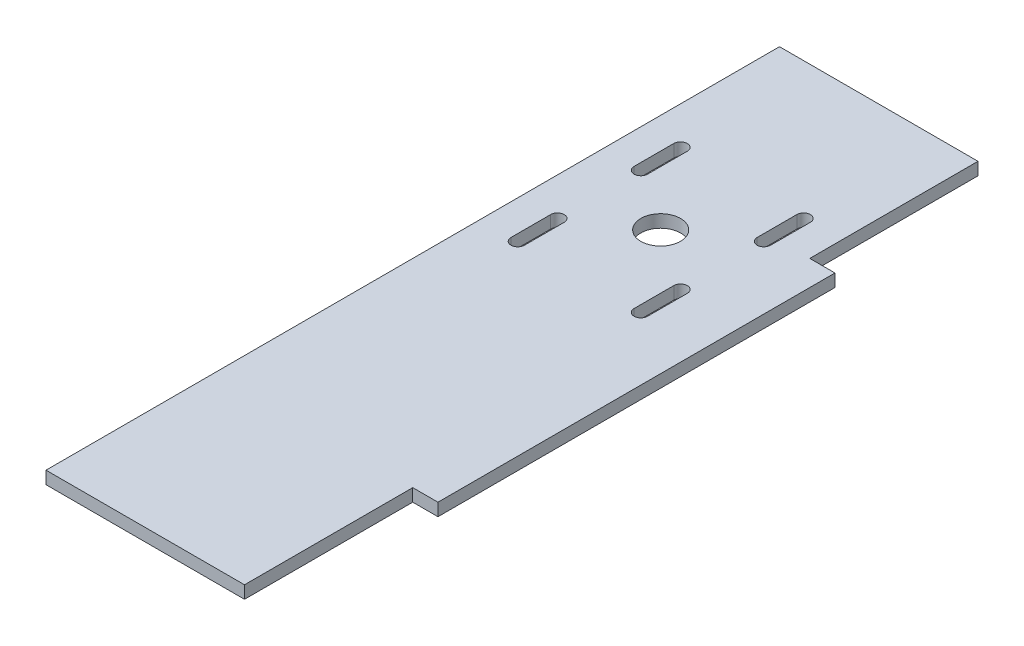
ISO-10303-21;
HEADER;
FILE_DESCRIPTION(('STEP AP214'),'2;1');
FILE_NAME('part.step','',(''),(''),'','','');
FILE_SCHEMA(('AUTOMOTIVE_DESIGN { 1 0 10303 214 1 1 1 1 }'));
ENDSEC;
DATA;
#1=APPLICATION_CONTEXT('core data for automotive mechanical design processes');
#2=APPLICATION_PROTOCOL_DEFINITION('international standard','automotive_design',2000,#1);
#3=PRODUCT_CONTEXT('',#1,'mechanical');
#4=PRODUCT('Part','Part','',(#3));
#5=PRODUCT_RELATED_PRODUCT_CATEGORY('part','',(#4));
#6=PRODUCT_DEFINITION_FORMATION('','',#4);
#7=PRODUCT_DEFINITION_CONTEXT('part definition',#1,'design');
#8=PRODUCT_DEFINITION('design','',#6,#7);
#9=PRODUCT_DEFINITION_SHAPE('','',#8);
#10=(LENGTH_UNIT() NAMED_UNIT(*) SI_UNIT(.MILLI.,.METRE.));
#11=(NAMED_UNIT(*) PLANE_ANGLE_UNIT() SI_UNIT($,.RADIAN.));
#12=(NAMED_UNIT(*) SI_UNIT($,.STERADIAN.) SOLID_ANGLE_UNIT());
#13=UNCERTAINTY_MEASURE_WITH_UNIT(LENGTH_MEASURE(1.E-05),#10,'distance_accuracy_value','');
#14=(GEOMETRIC_REPRESENTATION_CONTEXT(3) GLOBAL_UNCERTAINTY_ASSIGNED_CONTEXT((#13)) GLOBAL_UNIT_ASSIGNED_CONTEXT((#10,
#11,#12)) REPRESENTATION_CONTEXT('',''));
#15=CARTESIAN_POINT('',(0.,0.,0.));
#16=DIRECTION('',(0.,0.,1.));
#17=DIRECTION('',(1.,0.,0.));
#18=AXIS2_PLACEMENT_3D('',#15,#16,#17);
#19=CARTESIAN_POINT('',(-25.,3.175,0.));
#20=DIRECTION('',(-1.,0.,0.));
#21=DIRECTION('',(0.,0.,1.));
#22=AXIS2_PLACEMENT_3D('',#19,#20,#21);
#23=PLANE('',#22);
#24=DIRECTION('',(0.,0.,-1.));
#25=VECTOR('',#24,1.);
#26=CARTESIAN_POINT('',(-25.,0.,0.));
#27=LINE('',#26,#25);
#28=CARTESIAN_POINT('',(-25.,0.,142.375));
#29=VERTEX_POINT('',#28);
#30=CARTESIAN_POINT('',(-25.,0.,-42.375));
#31=VERTEX_POINT('',#30);
#32=EDGE_CURVE('E338',#29,#31,#27,.T.);
#33=ORIENTED_EDGE('',*,*,#32,.F.);
#34=DIRECTION('',(0.,-1.,0.));
#35=VECTOR('',#34,1.);
#36=CARTESIAN_POINT('',(-25.,3.175,142.375));
#37=LINE('',#36,#35);
#38=CARTESIAN_POINT('',(-25.,3.175,142.375));
#39=VERTEX_POINT('',#38);
#40=EDGE_CURVE('E11',#39,#29,#37,.T.);
#41=ORIENTED_EDGE('',*,*,#40,.F.);
#42=DIRECTION('',(0.,0.,-1.));
#43=VECTOR('',#42,1.);
#44=CARTESIAN_POINT('',(-25.,3.175,0.));
#45=LINE('',#44,#43);
#46=CARTESIAN_POINT('',(-25.,3.175,-42.375));
#47=VERTEX_POINT('',#46);
#48=EDGE_CURVE('E341',#39,#47,#45,.T.);
#49=ORIENTED_EDGE('',*,*,#48,.T.);
#50=DIRECTION('',(0.,-1.,0.));
#51=VECTOR('',#50,1.);
#52=CARTESIAN_POINT('',(-25.,3.175,-42.375));
#53=LINE('',#52,#51);
#54=EDGE_CURVE('E366',#47,#31,#53,.T.);
#55=ORIENTED_EDGE('',*,*,#54,.T.);
#56=EDGE_LOOP('',(#33,#41,#49,#55));
#57=FACE_BOUND('',#56,.T.);
#58=ADVANCED_FACE('F36',(#57),#23,.T.);
#59=CARTESIAN_POINT('',(0.,3.175,142.375));
#60=DIRECTION('',(0.,0.,1.));
#61=DIRECTION('',(1.,0.,0.));
#62=AXIS2_PLACEMENT_3D('',#59,#60,#61);
#63=PLANE('',#62);
#64=DIRECTION('',(-1.,0.,0.));
#65=VECTOR('',#64,1.);
#66=CARTESIAN_POINT('',(0.,0.,142.375));
#67=LINE('',#66,#65);
#68=CARTESIAN_POINT('',(25.,0.,142.375));
#69=VERTEX_POINT('',#68);
#70=EDGE_CURVE('E369',#69,#29,#67,.T.);
#71=ORIENTED_EDGE('',*,*,#70,.F.);
#72=DIRECTION('',(0.,-1.,0.));
#73=VECTOR('',#72,1.);
#74=CARTESIAN_POINT('',(25.,3.175,142.375));
#75=LINE('',#74,#73);
#76=CARTESIAN_POINT('',(25.,3.175,142.375));
#77=VERTEX_POINT('',#76);
#78=EDGE_CURVE('E43',#77,#69,#75,.T.);
#79=ORIENTED_EDGE('',*,*,#78,.F.);
#80=DIRECTION('',(-1.,0.,0.));
#81=VECTOR('',#80,1.);
#82=CARTESIAN_POINT('',(0.,3.175,142.375));
#83=LINE('',#82,#81);
#84=EDGE_CURVE('E344',#77,#39,#83,.T.);
#85=ORIENTED_EDGE('',*,*,#84,.T.);
#86=ORIENTED_EDGE('',*,*,#40,.T.);
#87=EDGE_LOOP('',(#71,#79,#85,#86));
#88=FACE_BOUND('',#87,.T.);
#89=ADVANCED_FACE('F406',(#88),#63,.T.);
#90=CARTESIAN_POINT('',(25.,3.175,0.));
#91=DIRECTION('',(1.,0.,0.));
#92=DIRECTION('',(0.,0.,-1.));
#93=AXIS2_PLACEMENT_3D('',#90,#91,#92);
#94=PLANE('',#93);
#95=DIRECTION('',(0.,0.,1.));
#96=VECTOR('',#95,1.);
#97=CARTESIAN_POINT('',(25.,0.,0.));
#98=LINE('',#97,#96);
#99=CARTESIAN_POINT('',(25.,0.,100.));
#100=VERTEX_POINT('',#99);
#101=EDGE_CURVE('E372',#100,#69,#98,.T.);
#102=ORIENTED_EDGE('',*,*,#101,.F.);
#103=DIRECTION('',(0.,-1.,0.));
#104=VECTOR('',#103,1.);
#105=CARTESIAN_POINT('',(25.,3.175,100.));
#106=LINE('',#105,#104);
#107=CARTESIAN_POINT('',(25.,3.175,100.));
#108=VERTEX_POINT('',#107);
#109=EDGE_CURVE('E398',#108,#100,#106,.T.);
#110=ORIENTED_EDGE('',*,*,#109,.F.);
#111=DIRECTION('',(0.,0.,1.));
#112=VECTOR('',#111,1.);
#113=CARTESIAN_POINT('',(25.,3.175,0.));
#114=LINE('',#113,#112);
#115=EDGE_CURVE('E348',#108,#77,#114,.T.);
#116=ORIENTED_EDGE('',*,*,#115,.T.);
#117=ORIENTED_EDGE('',*,*,#78,.T.);
#118=EDGE_LOOP('',(#102,#110,#116,#117));
#119=FACE_BOUND('',#118,.T.);
#120=ADVANCED_FACE('F402',(#119),#94,.T.);
#121=CARTESIAN_POINT('',(0.,3.175,100.));
#122=DIRECTION('',(0.,0.,1.));
#123=DIRECTION('',(1.,0.,0.));
#124=AXIS2_PLACEMENT_3D('',#121,#122,#123);
#125=PLANE('',#124);
#126=DIRECTION('',(-1.,0.,0.));
#127=VECTOR('',#126,1.);
#128=CARTESIAN_POINT('',(0.,0.,100.));
#129=LINE('',#128,#127);
#130=CARTESIAN_POINT('',(31.35,0.,100.));
#131=VERTEX_POINT('',#130);
#132=EDGE_CURVE('E375',#131,#100,#129,.T.);
#133=ORIENTED_EDGE('',*,*,#132,.F.);
#134=DIRECTION('',(0.,-1.,0.));
#135=VECTOR('',#134,1.);
#136=CARTESIAN_POINT('',(31.35,3.175,100.));
#137=LINE('',#136,#135);
#138=CARTESIAN_POINT('',(31.35,3.175,100.));
#139=VERTEX_POINT('',#138);
#140=EDGE_CURVE('E396',#139,#131,#137,.T.);
#141=ORIENTED_EDGE('',*,*,#140,.F.);
#142=DIRECTION('',(-1.,0.,0.));
#143=VECTOR('',#142,1.);
#144=CARTESIAN_POINT('',(0.,3.175,100.));
#145=LINE('',#144,#143);
#146=EDGE_CURVE('E351',#139,#108,#145,.T.);
#147=ORIENTED_EDGE('',*,*,#146,.T.);
#148=ORIENTED_EDGE('',*,*,#109,.T.);
#149=EDGE_LOOP('',(#133,#141,#147,#148));
#150=FACE_BOUND('',#149,.T.);
#151=ADVANCED_FACE('F412',(#150),#125,.T.);
#152=CARTESIAN_POINT('',(31.35,3.175,0.));
#153=DIRECTION('',(1.,0.,0.));
#154=DIRECTION('',(0.,0.,-1.));
#155=AXIS2_PLACEMENT_3D('',#152,#153,#154);
#156=PLANE('',#155);
#157=DIRECTION('',(0.,0.,1.));
#158=VECTOR('',#157,1.);
#159=CARTESIAN_POINT('',(31.35,0.,0.));
#160=LINE('',#159,#158);
#161=CARTESIAN_POINT('',(31.35,0.,0.));
#162=VERTEX_POINT('',#161);
#163=EDGE_CURVE('E378',#162,#131,#160,.T.);
#164=ORIENTED_EDGE('',*,*,#163,.F.);
#165=DIRECTION('',(0.,-1.,0.));
#166=VECTOR('',#165,1.);
#167=CARTESIAN_POINT('',(31.35,3.175,0.));
#168=LINE('',#167,#166);
#169=CARTESIAN_POINT('',(31.35,3.175,0.));
#170=VERTEX_POINT('',#169);
#171=EDGE_CURVE('E394',#170,#162,#168,.T.);
#172=ORIENTED_EDGE('',*,*,#171,.F.);
#173=DIRECTION('',(0.,0.,1.));
#174=VECTOR('',#173,1.);
#175=CARTESIAN_POINT('',(31.35,3.175,0.));
#176=LINE('',#175,#174);
#177=EDGE_CURVE('E354',#170,#139,#176,.T.);
#178=ORIENTED_EDGE('',*,*,#177,.T.);
#179=ORIENTED_EDGE('',*,*,#140,.T.);
#180=EDGE_LOOP('',(#164,#172,#178,#179));
#181=FACE_BOUND('',#180,.T.);
#182=ADVANCED_FACE('F432',(#181),#156,.T.);
#183=CARTESIAN_POINT('',(0.,3.175,0.));
#184=DIRECTION('',(0.,0.,-1.));
#185=DIRECTION('',(-1.,0.,0.));
#186=AXIS2_PLACEMENT_3D('',#183,#184,#185);
#187=PLANE('',#186);
#188=DIRECTION('',(1.,0.,0.));
#189=VECTOR('',#188,1.);
#190=CARTESIAN_POINT('',(0.,0.,0.));
#191=LINE('',#190,#189);
#192=CARTESIAN_POINT('',(25.,0.,0.));
#193=VERTEX_POINT('',#192);
#194=EDGE_CURVE('E381',#193,#162,#191,.T.);
#195=ORIENTED_EDGE('',*,*,#194,.F.);
#196=DIRECTION('',(0.,-1.,0.));
#197=VECTOR('',#196,1.);
#198=CARTESIAN_POINT('',(25.,3.175,0.));
#199=LINE('',#198,#197);
#200=CARTESIAN_POINT('',(25.,3.175,0.));
#201=VERTEX_POINT('',#200);
#202=EDGE_CURVE('E392',#201,#193,#199,.T.);
#203=ORIENTED_EDGE('',*,*,#202,.F.);
#204=DIRECTION('',(1.,0.,0.));
#205=VECTOR('',#204,1.);
#206=CARTESIAN_POINT('',(0.,3.175,0.));
#207=LINE('',#206,#205);
#208=EDGE_CURVE('E357',#201,#170,#207,.T.);
#209=ORIENTED_EDGE('',*,*,#208,.T.);
#210=ORIENTED_EDGE('',*,*,#171,.T.);
#211=EDGE_LOOP('',(#195,#203,#209,#210));
#212=FACE_BOUND('',#211,.T.);
#213=ADVANCED_FACE('F429',(#212),#187,.T.);
#214=CARTESIAN_POINT('',(25.,3.175,0.));
#215=DIRECTION('',(1.,0.,0.));
#216=DIRECTION('',(0.,0.,-1.));
#217=AXIS2_PLACEMENT_3D('',#214,#215,#216);
#218=PLANE('',#217);
#219=DIRECTION('',(0.,0.,1.));
#220=VECTOR('',#219,1.);
#221=CARTESIAN_POINT('',(25.,0.,0.));
#222=LINE('',#221,#220);
#223=CARTESIAN_POINT('',(25.,0.,-42.375));
#224=VERTEX_POINT('',#223);
#225=EDGE_CURVE('E384',#224,#193,#222,.T.);
#226=ORIENTED_EDGE('',*,*,#225,.F.);
#227=DIRECTION('',(0.,-1.,0.));
#228=VECTOR('',#227,1.);
#229=CARTESIAN_POINT('',(25.,3.175,-42.375));
#230=LINE('',#229,#228);
#231=CARTESIAN_POINT('',(25.,3.175,-42.375));
#232=VERTEX_POINT('',#231);
#233=EDGE_CURVE('E390',#232,#224,#230,.T.);
#234=ORIENTED_EDGE('',*,*,#233,.F.);
#235=DIRECTION('',(0.,0.,1.));
#236=VECTOR('',#235,1.);
#237=CARTESIAN_POINT('',(25.,3.175,0.));
#238=LINE('',#237,#236);
#239=EDGE_CURVE('E360',#232,#201,#238,.T.);
#240=ORIENTED_EDGE('',*,*,#239,.T.);
#241=ORIENTED_EDGE('',*,*,#202,.T.);
#242=EDGE_LOOP('',(#226,#234,#240,#241));
#243=FACE_BOUND('',#242,.T.);
#244=ADVANCED_FACE('F426',(#243),#218,.T.);
#245=CARTESIAN_POINT('',(0.,3.175,-42.375));
#246=DIRECTION('',(0.,0.,-1.));
#247=DIRECTION('',(-1.,0.,0.));
#248=AXIS2_PLACEMENT_3D('',#245,#246,#247);
#249=PLANE('',#248);
#250=DIRECTION('',(1.,0.,0.));
#251=VECTOR('',#250,1.);
#252=CARTESIAN_POINT('',(0.,0.,-42.375));
#253=LINE('',#252,#251);
#254=EDGE_CURVE('E345',#31,#224,#253,.T.);
#255=ORIENTED_EDGE('',*,*,#254,.F.);
#256=ORIENTED_EDGE('',*,*,#54,.F.);
#257=DIRECTION('',(1.,0.,0.));
#258=VECTOR('',#257,1.);
#259=CARTESIAN_POINT('',(0.,3.175,-42.375));
#260=LINE('',#259,#258);
#261=EDGE_CURVE('E363',#47,#232,#260,.T.);
#262=ORIENTED_EDGE('',*,*,#261,.T.);
#263=ORIENTED_EDGE('',*,*,#233,.T.);
#264=EDGE_LOOP('',(#255,#256,#262,#263));
#265=FACE_BOUND('',#264,.T.);
#266=ADVANCED_FACE('F423',(#265),#249,.T.);
#267=CARTESIAN_POINT('',(0.,3.175,0.));
#268=DIRECTION('',(0.,1.,0.));
#269=DIRECTION('',(0.,0.,1.));
#270=AXIS2_PLACEMENT_3D('',#267,#268,#269);
#271=PLANE('',#270);
#272=DIRECTION('',(0.,0.,1.));
#273=VECTOR('',#272,1.);
#274=CARTESIAN_POINT('',(-17.2,3.175,33.05));
#275=LINE('',#274,#273);
#276=CARTESIAN_POINT('',(-17.2,3.175,23.05));
#277=VERTEX_POINT('',#276);
#278=CARTESIAN_POINT('',(-17.2,3.175,33.05));
#279=VERTEX_POINT('',#278);
#280=EDGE_CURVE('E220',#277,#279,#275,.T.);
#281=ORIENTED_EDGE('',*,*,#280,.F.);
#282=CARTESIAN_POINT('',(-15.5,3.175,23.05));
#283=DIRECTION('',(0.,1.,0.));
#284=DIRECTION('',(0.,0.,-1.));
#285=AXIS2_PLACEMENT_3D('',#282,#283,#284);
#286=CIRCLE('',#285,1.7);
#287=CARTESIAN_POINT('',(-13.8,3.175,23.05));
#288=VERTEX_POINT('',#287);
#289=EDGE_CURVE('E222',#288,#277,#286,.T.);
#290=ORIENTED_EDGE('',*,*,#289,.F.);
#291=DIRECTION('',(0.,0.,-1.));
#292=VECTOR('',#291,1.);
#293=CARTESIAN_POINT('',(-13.8,3.175,33.05));
#294=LINE('',#293,#292);
#295=CARTESIAN_POINT('',(-13.8,3.175,33.05));
#296=VERTEX_POINT('',#295);
#297=EDGE_CURVE('E228',#296,#288,#294,.T.);
#298=ORIENTED_EDGE('',*,*,#297,.F.);
#299=CARTESIAN_POINT('',(-15.5,3.175,33.05));
#300=DIRECTION('',(0.,1.,0.));
#301=DIRECTION('',(0.,0.,-1.));
#302=AXIS2_PLACEMENT_3D('',#299,#300,#301);
#303=CIRCLE('',#302,1.7);
#304=EDGE_CURVE('E214',#279,#296,#303,.T.);
#305=ORIENTED_EDGE('',*,*,#304,.F.);
#306=EDGE_LOOP('',(#281,#290,#298,#305));
#307=FACE_BOUND('',#306,.T.);
#308=DIRECTION('',(0.,0.,1.));
#309=VECTOR('',#308,1.);
#310=CARTESIAN_POINT('',(13.8,3.175,33.05));
#311=LINE('',#310,#309);
#312=CARTESIAN_POINT('',(13.8,3.175,23.05));
#313=VERTEX_POINT('',#312);
#314=CARTESIAN_POINT('',(13.8,3.175,33.05));
#315=VERTEX_POINT('',#314);
#316=EDGE_CURVE('E243',#313,#315,#311,.T.);
#317=ORIENTED_EDGE('',*,*,#316,.F.);
#318=CARTESIAN_POINT('',(15.5,3.175,23.05));
#319=DIRECTION('',(0.,1.,0.));
#320=DIRECTION('',(0.,0.,-1.));
#321=AXIS2_PLACEMENT_3D('',#318,#319,#320);
#322=CIRCLE('',#321,1.69999999999999);
#323=CARTESIAN_POINT('',(17.2,3.175,23.05));
#324=VERTEX_POINT('',#323);
#325=EDGE_CURVE('E255',#324,#313,#322,.T.);
#326=ORIENTED_EDGE('',*,*,#325,.F.);
#327=DIRECTION('',(0.,0.,-1.));
#328=VECTOR('',#327,1.);
#329=CARTESIAN_POINT('',(17.2,3.175,33.05));
#330=LINE('',#329,#328);
#331=CARTESIAN_POINT('',(17.2,3.175,33.05));
#332=VERTEX_POINT('',#331);
#333=EDGE_CURVE('E253',#332,#324,#330,.T.);
#334=ORIENTED_EDGE('',*,*,#333,.F.);
#335=CARTESIAN_POINT('',(15.5,3.175,33.05));
#336=DIRECTION('',(0.,1.,0.));
#337=DIRECTION('',(0.,0.,-1.));
#338=AXIS2_PLACEMENT_3D('',#335,#336,#337);
#339=CIRCLE('',#338,1.69999999999999);
#340=EDGE_CURVE('E234',#315,#332,#339,.T.);
#341=ORIENTED_EDGE('',*,*,#340,.F.);
#342=EDGE_LOOP('',(#317,#326,#334,#341));
#343=FACE_BOUND('',#342,.T.);
#344=DIRECTION('',(0.,0.,-1.));
#345=VECTOR('',#344,1.);
#346=CARTESIAN_POINT('',(-13.8,3.175,-7.95000000000001));
#347=LINE('',#346,#345);
#348=CARTESIAN_POINT('',(-13.8,3.175,2.04999999999999));
#349=VERTEX_POINT('',#348);
#350=CARTESIAN_POINT('',(-13.8,3.175,-7.95000000000001));
#351=VERTEX_POINT('',#350);
#352=EDGE_CURVE('E273',#349,#351,#347,.T.);
#353=ORIENTED_EDGE('',*,*,#352,.F.);
#354=CARTESIAN_POINT('',(-15.5,3.175,2.04999999999999));
#355=DIRECTION('',(0.,1.,0.));
#356=DIRECTION('',(0.,0.,1.));
#357=AXIS2_PLACEMENT_3D('',#354,#355,#356);
#358=CIRCLE('',#357,1.7);
#359=CARTESIAN_POINT('',(-17.2,3.175,2.05));
#360=VERTEX_POINT('',#359);
#361=EDGE_CURVE('E287',#360,#349,#358,.T.);
#362=ORIENTED_EDGE('',*,*,#361,.F.);
#363=DIRECTION('',(0.,0.,1.));
#364=VECTOR('',#363,1.);
#365=CARTESIAN_POINT('',(-17.2,3.175,-7.95000000000001));
#366=LINE('',#365,#364);
#367=CARTESIAN_POINT('',(-17.2,3.175,-7.95000000000001));
#368=VERTEX_POINT('',#367);
#369=EDGE_CURVE('E285',#368,#360,#366,.T.);
#370=ORIENTED_EDGE('',*,*,#369,.F.);
#371=CARTESIAN_POINT('',(-15.5,3.175,-7.95000000000001));
#372=DIRECTION('',(0.,1.,0.));
#373=DIRECTION('',(0.,0.,1.));
#374=AXIS2_PLACEMENT_3D('',#371,#372,#373);
#375=CIRCLE('',#374,1.7);
#376=EDGE_CURVE('E262',#351,#368,#375,.T.);
#377=ORIENTED_EDGE('',*,*,#376,.F.);
#378=EDGE_LOOP('',(#353,#362,#370,#377));
#379=FACE_BOUND('',#378,.T.);
#380=DIRECTION('',(0.,0.,-1.));
#381=VECTOR('',#380,1.);
#382=CARTESIAN_POINT('',(17.2,3.175,-7.95000000000002));
#383=LINE('',#382,#381);
#384=CARTESIAN_POINT('',(17.2,3.175,2.04999999999998));
#385=VERTEX_POINT('',#384);
#386=CARTESIAN_POINT('',(17.2,3.175,-7.95000000000002));
#387=VERTEX_POINT('',#386);
#388=EDGE_CURVE('E306',#385,#387,#383,.T.);
#389=ORIENTED_EDGE('',*,*,#388,.F.);
#390=CARTESIAN_POINT('',(15.5,3.175,2.04999999999998));
#391=DIRECTION('',(0.,1.,0.));
#392=DIRECTION('',(0.,0.,1.));
#393=AXIS2_PLACEMENT_3D('',#390,#391,#392);
#394=CIRCLE('',#393,1.69999999999999);
#395=CARTESIAN_POINT('',(13.8,3.175,2.04999999999999));
#396=VERTEX_POINT('',#395);
#397=EDGE_CURVE('E320',#396,#385,#394,.T.);
#398=ORIENTED_EDGE('',*,*,#397,.F.);
#399=DIRECTION('',(0.,0.,1.));
#400=VECTOR('',#399,1.);
#401=CARTESIAN_POINT('',(13.8,3.175,-7.95000000000003));
#402=LINE('',#401,#400);
#403=CARTESIAN_POINT('',(13.8,3.175,-7.95000000000003));
#404=VERTEX_POINT('',#403);
#405=EDGE_CURVE('E318',#404,#396,#402,.T.);
#406=ORIENTED_EDGE('',*,*,#405,.F.);
#407=CARTESIAN_POINT('',(15.5,3.175,-7.95000000000002));
#408=DIRECTION('',(0.,1.,0.));
#409=DIRECTION('',(0.,0.,1.));
#410=AXIS2_PLACEMENT_3D('',#407,#408,#409);
#411=CIRCLE('',#410,1.69999999999999);
#412=EDGE_CURVE('E294',#387,#404,#411,.T.);
#413=ORIENTED_EDGE('',*,*,#412,.F.);
#414=EDGE_LOOP('',(#389,#398,#406,#413));
#415=FACE_BOUND('',#414,.T.);
#416=CARTESIAN_POINT('',(0.,3.175,12.55));
#417=DIRECTION('',(0.,1.,0.));
#418=DIRECTION('',(0.,0.,1.));
#419=AXIS2_PLACEMENT_3D('',#416,#417,#418);
#420=CIRCLE('',#419,5.);
#421=CARTESIAN_POINT('',(0.,3.175,17.55));
#422=VERTEX_POINT('',#421);
#423=EDGE_CURVE('E327',#422,#422,#420,.T.);
#424=ORIENTED_EDGE('',*,*,#423,.F.);
#425=EDGE_LOOP('',(#424));
#426=FACE_BOUND('',#425,.T.);
#427=ORIENTED_EDGE('',*,*,#48,.F.);
#428=ORIENTED_EDGE('',*,*,#84,.F.);
#429=ORIENTED_EDGE('',*,*,#115,.F.);
#430=ORIENTED_EDGE('',*,*,#146,.F.);
#431=ORIENTED_EDGE('',*,*,#177,.F.);
#432=ORIENTED_EDGE('',*,*,#208,.F.);
#433=ORIENTED_EDGE('',*,*,#239,.F.);
#434=ORIENTED_EDGE('',*,*,#261,.F.);
#435=EDGE_LOOP('',(#427,#428,#429,#430,#431,#432,#433,#434));
#436=FACE_BOUND('',#435,.T.);
#437=ADVANCED_FACE('F416',(#307,#343,#379,#415,#426,#436),#271,.T.);
#438=CARTESIAN_POINT('',(0.,0.,0.));
#439=DIRECTION('',(0.,1.,0.));
#440=DIRECTION('',(0.,0.,1.));
#441=AXIS2_PLACEMENT_3D('',#438,#439,#440);
#442=PLANE('',#441);
#443=CARTESIAN_POINT('',(-15.5,0.,2.04999999999999));
#444=DIRECTION('',(0.,1.,0.));
#445=DIRECTION('',(0.,0.,1.));
#446=AXIS2_PLACEMENT_3D('',#443,#444,#445);
#447=CIRCLE('',#446,1.7);
#448=CARTESIAN_POINT('',(-17.2,0.,2.05));
#449=VERTEX_POINT('',#448);
#450=CARTESIAN_POINT('',(-13.8,0.,2.04999999999999));
#451=VERTEX_POINT('',#450);
#452=EDGE_CURVE('E276',#449,#451,#447,.T.);
#453=ORIENTED_EDGE('',*,*,#452,.T.);
#454=DIRECTION('',(0.,0.,-1.));
#455=VECTOR('',#454,1.);
#456=CARTESIAN_POINT('',(-13.8,0.,-7.95000000000001));
#457=LINE('',#456,#455);
#458=CARTESIAN_POINT('',(-13.8,0.,-7.95000000000001));
#459=VERTEX_POINT('',#458);
#460=EDGE_CURVE('E279',#451,#459,#457,.T.);
#461=ORIENTED_EDGE('',*,*,#460,.T.);
#462=CARTESIAN_POINT('',(-15.5,0.,-7.95000000000001));
#463=DIRECTION('',(0.,1.,0.));
#464=DIRECTION('',(0.,0.,1.));
#465=AXIS2_PLACEMENT_3D('',#462,#463,#464);
#466=CIRCLE('',#465,1.7);
#467=CARTESIAN_POINT('',(-17.2,0.,-7.95000000000001));
#468=VERTEX_POINT('',#467);
#469=EDGE_CURVE('E269',#459,#468,#466,.T.);
#470=ORIENTED_EDGE('',*,*,#469,.T.);
#471=DIRECTION('',(0.,0.,1.));
#472=VECTOR('',#471,1.);
#473=CARTESIAN_POINT('',(-17.2,0.,-7.95000000000001));
#474=LINE('',#473,#472);
#475=EDGE_CURVE('E272',#468,#449,#474,.T.);
#476=ORIENTED_EDGE('',*,*,#475,.T.);
#477=EDGE_LOOP('',(#453,#461,#470,#476));
#478=FACE_BOUND('',#477,.T.);
#479=CARTESIAN_POINT('',(15.5,0.,2.04999999999998));
#480=DIRECTION('',(0.,1.,0.));
#481=DIRECTION('',(0.,0.,1.));
#482=AXIS2_PLACEMENT_3D('',#479,#480,#481);
#483=CIRCLE('',#482,1.69999999999999);
#484=CARTESIAN_POINT('',(13.8,0.,2.04999999999999));
#485=VERTEX_POINT('',#484);
#486=CARTESIAN_POINT('',(17.2,0.,2.04999999999998));
#487=VERTEX_POINT('',#486);
#488=EDGE_CURVE('E309',#485,#487,#483,.T.);
#489=ORIENTED_EDGE('',*,*,#488,.T.);
#490=DIRECTION('',(0.,0.,-1.));
#491=VECTOR('',#490,1.);
#492=CARTESIAN_POINT('',(17.2,0.,-7.95000000000002));
#493=LINE('',#492,#491);
#494=CARTESIAN_POINT('',(17.2,0.,-7.95000000000002));
#495=VERTEX_POINT('',#494);
#496=EDGE_CURVE('E312',#487,#495,#493,.T.);
#497=ORIENTED_EDGE('',*,*,#496,.T.);
#498=CARTESIAN_POINT('',(15.5,0.,-7.95000000000002));
#499=DIRECTION('',(0.,1.,0.));
#500=DIRECTION('',(0.,0.,1.));
#501=AXIS2_PLACEMENT_3D('',#498,#499,#500);
#502=CIRCLE('',#501,1.69999999999999);
#503=CARTESIAN_POINT('',(13.8,0.,-7.95000000000003));
#504=VERTEX_POINT('',#503);
#505=EDGE_CURVE('E302',#495,#504,#502,.T.);
#506=ORIENTED_EDGE('',*,*,#505,.T.);
#507=DIRECTION('',(0.,0.,1.));
#508=VECTOR('',#507,1.);
#509=CARTESIAN_POINT('',(13.8,0.,-7.95000000000003));
#510=LINE('',#509,#508);
#511=EDGE_CURVE('E305',#504,#485,#510,.T.);
#512=ORIENTED_EDGE('',*,*,#511,.T.);
#513=EDGE_LOOP('',(#489,#497,#506,#512));
#514=FACE_BOUND('',#513,.T.);
#515=CARTESIAN_POINT('',(15.5,0.,23.05));
#516=DIRECTION('',(0.,1.,0.));
#517=DIRECTION('',(0.,0.,-1.));
#518=AXIS2_PLACEMENT_3D('',#515,#516,#517);
#519=CIRCLE('',#518,1.69999999999999);
#520=CARTESIAN_POINT('',(17.2,0.,23.05));
#521=VERTEX_POINT('',#520);
#522=CARTESIAN_POINT('',(13.8,0.,23.05));
#523=VERTEX_POINT('',#522);
#524=EDGE_CURVE('E58',#521,#523,#519,.T.);
#525=ORIENTED_EDGE('',*,*,#524,.T.);
#526=DIRECTION('',(0.,0.,1.));
#527=VECTOR('',#526,1.);
#528=CARTESIAN_POINT('',(13.8,0.,33.05));
#529=LINE('',#528,#527);
#530=CARTESIAN_POINT('',(13.8,0.,33.05));
#531=VERTEX_POINT('',#530);
#532=EDGE_CURVE('E247',#523,#531,#529,.T.);
#533=ORIENTED_EDGE('',*,*,#532,.T.);
#534=CARTESIAN_POINT('',(15.5,0.,33.05));
#535=DIRECTION('',(0.,1.,0.));
#536=DIRECTION('',(0.,0.,-1.));
#537=AXIS2_PLACEMENT_3D('',#534,#535,#536);
#538=CIRCLE('',#537,1.69999999999999);
#539=CARTESIAN_POINT('',(17.2,0.,33.05));
#540=VERTEX_POINT('',#539);
#541=EDGE_CURVE('E239',#531,#540,#538,.T.);
#542=ORIENTED_EDGE('',*,*,#541,.T.);
#543=DIRECTION('',(0.,0.,-1.));
#544=VECTOR('',#543,1.);
#545=CARTESIAN_POINT('',(17.2,0.,33.05));
#546=LINE('',#545,#544);
#547=EDGE_CURVE('E242',#540,#521,#546,.T.);
#548=ORIENTED_EDGE('',*,*,#547,.T.);
#549=EDGE_LOOP('',(#525,#533,#542,#548));
#550=FACE_BOUND('',#549,.T.);
#551=CARTESIAN_POINT('',(-15.5,0.,23.05));
#552=DIRECTION('',(0.,1.,0.));
#553=DIRECTION('',(0.,0.,-1.));
#554=AXIS2_PLACEMENT_3D('',#551,#552,#553);
#555=CIRCLE('',#554,1.7);
#556=CARTESIAN_POINT('',(-13.8,0.,23.05));
#557=VERTEX_POINT('',#556);
#558=CARTESIAN_POINT('',(-17.2,0.,23.05));
#559=VERTEX_POINT('',#558);
#560=EDGE_CURVE('E50',#557,#559,#555,.T.);
#561=ORIENTED_EDGE('',*,*,#560,.T.);
#562=DIRECTION('',(0.,0.,1.));
#563=VECTOR('',#562,1.);
#564=CARTESIAN_POINT('',(-17.2,0.,33.05));
#565=LINE('',#564,#563);
#566=CARTESIAN_POINT('',(-17.2,0.,33.05));
#567=VERTEX_POINT('',#566);
#568=EDGE_CURVE('E216',#559,#567,#565,.T.);
#569=ORIENTED_EDGE('',*,*,#568,.T.);
#570=CARTESIAN_POINT('',(-15.5,0.,33.05));
#571=DIRECTION('',(0.,1.,0.));
#572=DIRECTION('',(0.,0.,-1.));
#573=AXIS2_PLACEMENT_3D('',#570,#571,#572);
#574=CIRCLE('',#573,1.7);
#575=CARTESIAN_POINT('',(-13.8,0.,33.05));
#576=VERTEX_POINT('',#575);
#577=EDGE_CURVE('E206',#567,#576,#574,.T.);
#578=ORIENTED_EDGE('',*,*,#577,.T.);
#579=DIRECTION('',(0.,0.,-1.));
#580=VECTOR('',#579,1.);
#581=CARTESIAN_POINT('',(-13.8,0.,33.05));
#582=LINE('',#581,#580);
#583=EDGE_CURVE('E198',#576,#557,#582,.T.);
#584=ORIENTED_EDGE('',*,*,#583,.T.);
#585=EDGE_LOOP('',(#561,#569,#578,#584));
#586=FACE_BOUND('',#585,.T.);
#587=CARTESIAN_POINT('',(0.,0.,12.55));
#588=DIRECTION('',(0.,1.,0.));
#589=DIRECTION('',(0.,0.,1.));
#590=AXIS2_PLACEMENT_3D('',#587,#588,#589);
#591=CIRCLE('',#590,5.);
#592=CARTESIAN_POINT('',(0.,0.,17.55));
#593=VERTEX_POINT('',#592);
#594=EDGE_CURVE('E335',#593,#593,#591,.T.);
#595=ORIENTED_EDGE('',*,*,#594,.T.);
#596=EDGE_LOOP('',(#595));
#597=FACE_BOUND('',#596,.T.);
#598=ORIENTED_EDGE('',*,*,#32,.T.);
#599=ORIENTED_EDGE('',*,*,#254,.T.);
#600=ORIENTED_EDGE('',*,*,#225,.T.);
#601=ORIENTED_EDGE('',*,*,#194,.T.);
#602=ORIENTED_EDGE('',*,*,#163,.T.);
#603=ORIENTED_EDGE('',*,*,#132,.T.);
#604=ORIENTED_EDGE('',*,*,#101,.T.);
#605=ORIENTED_EDGE('',*,*,#70,.T.);
#606=EDGE_LOOP('',(#598,#599,#600,#601,#602,#603,#604,#605));
#607=FACE_BOUND('',#606,.T.);
#608=ADVANCED_FACE('F218',(#478,#514,#550,#586,#597,#607),#442,.F.);
#609=CARTESIAN_POINT('',(0.,0.,12.55));
#610=DIRECTION('',(0.,1.,0.));
#611=DIRECTION('',(0.,0.,1.));
#612=AXIS2_PLACEMENT_3D('',#609,#610,#611);
#613=CYLINDRICAL_SURFACE('',#612,5.);
#614=ORIENTED_EDGE('',*,*,#594,.F.);
#615=EDGE_LOOP('',(#614));
#616=FACE_BOUND('',#615,.T.);
#617=ORIENTED_EDGE('',*,*,#423,.T.);
#618=EDGE_LOOP('',(#617));
#619=FACE_BOUND('',#618,.T.);
#620=ADVANCED_FACE('F488',(#616,#619),#613,.F.);
#621=CARTESIAN_POINT('',(17.2,0.,-7.95000000000002));
#622=DIRECTION('',(1.,0.,0.));
#623=DIRECTION('',(0.,0.,-1.));
#624=AXIS2_PLACEMENT_3D('',#621,#622,#623);
#625=PLANE('',#624);
#626=ORIENTED_EDGE('',*,*,#388,.T.);
#627=DIRECTION('',(0.,1.,0.));
#628=VECTOR('',#627,1.);
#629=CARTESIAN_POINT('',(17.2,0.,-7.95000000000002));
#630=LINE('',#629,#628);
#631=EDGE_CURVE('E324',#495,#387,#630,.T.);
#632=ORIENTED_EDGE('',*,*,#631,.F.);
#633=ORIENTED_EDGE('',*,*,#496,.F.);
#634=DIRECTION('',(0.,1.,0.));
#635=VECTOR('',#634,1.);
#636=CARTESIAN_POINT('',(17.2,0.,2.04999999999998));
#637=LINE('',#636,#635);
#638=EDGE_CURVE('E328',#487,#385,#637,.T.);
#639=ORIENTED_EDGE('',*,*,#638,.T.);
#640=EDGE_LOOP('',(#626,#632,#633,#639));
#641=FACE_BOUND('',#640,.T.);
#642=ADVANCED_FACE('F493',(#641),#625,.F.);
#643=CARTESIAN_POINT('',(13.8,0.,-7.95000000000003));
#644=DIRECTION('',(-1.,0.,0.));
#645=DIRECTION('',(0.,0.,1.));
#646=AXIS2_PLACEMENT_3D('',#643,#644,#645);
#647=PLANE('',#646);
#648=ORIENTED_EDGE('',*,*,#405,.T.);
#649=DIRECTION('',(0.,1.,0.));
#650=VECTOR('',#649,1.);
#651=CARTESIAN_POINT('',(13.8,0.,2.04999999999999));
#652=LINE('',#651,#650);
#653=EDGE_CURVE('E331',#485,#396,#652,.T.);
#654=ORIENTED_EDGE('',*,*,#653,.F.);
#655=ORIENTED_EDGE('',*,*,#511,.F.);
#656=DIRECTION('',(0.,1.,0.));
#657=VECTOR('',#656,1.);
#658=CARTESIAN_POINT('',(13.8,0.,-7.95000000000003));
#659=LINE('',#658,#657);
#660=EDGE_CURVE('E315',#504,#404,#659,.T.);
#661=ORIENTED_EDGE('',*,*,#660,.T.);
#662=EDGE_LOOP('',(#648,#654,#655,#661));
#663=FACE_BOUND('',#662,.T.);
#664=ADVANCED_FACE('F519',(#663),#647,.F.);
#665=CARTESIAN_POINT('',(15.5,0.,-7.95000000000002));
#666=DIRECTION('',(0.,1.,0.));
#667=DIRECTION('',(0.,0.,1.));
#668=AXIS2_PLACEMENT_3D('',#665,#666,#667);
#669=CYLINDRICAL_SURFACE('',#668,1.69999999999999);
#670=ORIENTED_EDGE('',*,*,#412,.T.);
#671=ORIENTED_EDGE('',*,*,#660,.F.);
#672=ORIENTED_EDGE('',*,*,#505,.F.);
#673=ORIENTED_EDGE('',*,*,#631,.T.);
#674=EDGE_LOOP('',(#670,#671,#672,#673));
#675=FACE_BOUND('',#674,.T.);
#676=ADVANCED_FACE('F529',(#675),#669,.F.);
#677=CARTESIAN_POINT('',(15.5,0.,2.04999999999998));
#678=DIRECTION('',(0.,1.,0.));
#679=DIRECTION('',(0.,0.,1.));
#680=AXIS2_PLACEMENT_3D('',#677,#678,#679);
#681=CYLINDRICAL_SURFACE('',#680,1.69999999999999);
#682=ORIENTED_EDGE('',*,*,#397,.T.);
#683=ORIENTED_EDGE('',*,*,#638,.F.);
#684=ORIENTED_EDGE('',*,*,#488,.F.);
#685=ORIENTED_EDGE('',*,*,#653,.T.);
#686=EDGE_LOOP('',(#682,#683,#684,#685));
#687=FACE_BOUND('',#686,.T.);
#688=ADVANCED_FACE('F539',(#687),#681,.F.);
#689=CARTESIAN_POINT('',(-13.8,0.,-7.95000000000001));
#690=DIRECTION('',(1.,0.,0.));
#691=DIRECTION('',(0.,0.,-1.));
#692=AXIS2_PLACEMENT_3D('',#689,#690,#691);
#693=PLANE('',#692);
#694=ORIENTED_EDGE('',*,*,#352,.T.);
#695=DIRECTION('',(0.,1.,0.));
#696=VECTOR('',#695,1.);
#697=CARTESIAN_POINT('',(-13.8,0.,-7.95000000000001));
#698=LINE('',#697,#696);
#699=EDGE_CURVE('E291',#459,#351,#698,.T.);
#700=ORIENTED_EDGE('',*,*,#699,.F.);
#701=ORIENTED_EDGE('',*,*,#460,.F.);
#702=DIRECTION('',(0.,1.,0.));
#703=VECTOR('',#702,1.);
#704=CARTESIAN_POINT('',(-13.8,0.,2.04999999999999));
#705=LINE('',#704,#703);
#706=EDGE_CURVE('E295',#451,#349,#705,.T.);
#707=ORIENTED_EDGE('',*,*,#706,.T.);
#708=EDGE_LOOP('',(#694,#700,#701,#707));
#709=FACE_BOUND('',#708,.T.);
#710=ADVANCED_FACE('F549',(#709),#693,.F.);
#711=CARTESIAN_POINT('',(-17.2,0.,-7.95000000000001));
#712=DIRECTION('',(-1.,0.,0.));
#713=DIRECTION('',(0.,0.,1.));
#714=AXIS2_PLACEMENT_3D('',#711,#712,#713);
#715=PLANE('',#714);
#716=ORIENTED_EDGE('',*,*,#369,.T.);
#717=DIRECTION('',(0.,1.,0.));
#718=VECTOR('',#717,1.);
#719=CARTESIAN_POINT('',(-17.2,0.,2.05));
#720=LINE('',#719,#718);
#721=EDGE_CURVE('E298',#449,#360,#720,.T.);
#722=ORIENTED_EDGE('',*,*,#721,.F.);
#723=ORIENTED_EDGE('',*,*,#475,.F.);
#724=DIRECTION('',(0.,1.,0.));
#725=VECTOR('',#724,1.);
#726=CARTESIAN_POINT('',(-17.2,0.,-7.95000000000001));
#727=LINE('',#726,#725);
#728=EDGE_CURVE('E282',#468,#368,#727,.T.);
#729=ORIENTED_EDGE('',*,*,#728,.T.);
#730=EDGE_LOOP('',(#716,#722,#723,#729));
#731=FACE_BOUND('',#730,.T.);
#732=ADVANCED_FACE('F559',(#731),#715,.F.);
#733=CARTESIAN_POINT('',(-15.5,0.,-7.95000000000001));
#734=DIRECTION('',(0.,1.,0.));
#735=DIRECTION('',(0.,0.,1.));
#736=AXIS2_PLACEMENT_3D('',#733,#734,#735);
#737=CYLINDRICAL_SURFACE('',#736,1.7);
#738=ORIENTED_EDGE('',*,*,#376,.T.);
#739=ORIENTED_EDGE('',*,*,#728,.F.);
#740=ORIENTED_EDGE('',*,*,#469,.F.);
#741=ORIENTED_EDGE('',*,*,#699,.T.);
#742=EDGE_LOOP('',(#738,#739,#740,#741));
#743=FACE_BOUND('',#742,.T.);
#744=ADVANCED_FACE('F569',(#743),#737,.F.);
#745=CARTESIAN_POINT('',(-15.5,0.,2.04999999999999));
#746=DIRECTION('',(0.,1.,0.));
#747=DIRECTION('',(0.,0.,1.));
#748=AXIS2_PLACEMENT_3D('',#745,#746,#747);
#749=CYLINDRICAL_SURFACE('',#748,1.7);
#750=ORIENTED_EDGE('',*,*,#361,.T.);
#751=ORIENTED_EDGE('',*,*,#706,.F.);
#752=ORIENTED_EDGE('',*,*,#452,.F.);
#753=ORIENTED_EDGE('',*,*,#721,.T.);
#754=EDGE_LOOP('',(#750,#751,#752,#753));
#755=FACE_BOUND('',#754,.T.);
#756=ADVANCED_FACE('F579',(#755),#749,.F.);
#757=CARTESIAN_POINT('',(13.8,0.,33.05));
#758=DIRECTION('',(-1.,0.,0.));
#759=DIRECTION('',(0.,0.,1.));
#760=AXIS2_PLACEMENT_3D('',#757,#758,#759);
#761=PLANE('',#760);
#762=ORIENTED_EDGE('',*,*,#316,.T.);
#763=DIRECTION('',(0.,1.,0.));
#764=VECTOR('',#763,1.);
#765=CARTESIAN_POINT('',(13.8,0.,33.05));
#766=LINE('',#765,#764);
#767=EDGE_CURVE('E259',#531,#315,#766,.T.);
#768=ORIENTED_EDGE('',*,*,#767,.F.);
#769=ORIENTED_EDGE('',*,*,#532,.F.);
#770=DIRECTION('',(0.,1.,0.));
#771=VECTOR('',#770,1.);
#772=CARTESIAN_POINT('',(13.8,0.,23.05));
#773=LINE('',#772,#771);
#774=EDGE_CURVE('E263',#523,#313,#773,.T.);
#775=ORIENTED_EDGE('',*,*,#774,.T.);
#776=EDGE_LOOP('',(#762,#768,#769,#775));
#777=FACE_BOUND('',#776,.T.);
#778=ADVANCED_FACE('F589',(#777),#761,.F.);
#779=CARTESIAN_POINT('',(17.2,0.,33.05));
#780=DIRECTION('',(1.,0.,0.));
#781=DIRECTION('',(0.,0.,-1.));
#782=AXIS2_PLACEMENT_3D('',#779,#780,#781);
#783=PLANE('',#782);
#784=ORIENTED_EDGE('',*,*,#333,.T.);
#785=DIRECTION('',(0.,1.,0.));
#786=VECTOR('',#785,1.);
#787=CARTESIAN_POINT('',(17.2,0.,23.05));
#788=LINE('',#787,#786);
#789=EDGE_CURVE('E266',#521,#324,#788,.T.);
#790=ORIENTED_EDGE('',*,*,#789,.F.);
#791=ORIENTED_EDGE('',*,*,#547,.F.);
#792=DIRECTION('',(0.,1.,0.));
#793=VECTOR('',#792,1.);
#794=CARTESIAN_POINT('',(17.2,0.,33.05));
#795=LINE('',#794,#793);
#796=EDGE_CURVE('E250',#540,#332,#795,.T.);
#797=ORIENTED_EDGE('',*,*,#796,.T.);
#798=EDGE_LOOP('',(#784,#790,#791,#797));
#799=FACE_BOUND('',#798,.T.);
#800=ADVANCED_FACE('F599',(#799),#783,.F.);
#801=CARTESIAN_POINT('',(15.5,0.,33.05));
#802=DIRECTION('',(0.,1.,0.));
#803=DIRECTION('',(0.,0.,1.));
#804=AXIS2_PLACEMENT_3D('',#801,#802,#803);
#805=CYLINDRICAL_SURFACE('',#804,1.69999999999999);
#806=ORIENTED_EDGE('',*,*,#340,.T.);
#807=ORIENTED_EDGE('',*,*,#796,.F.);
#808=ORIENTED_EDGE('',*,*,#541,.F.);
#809=ORIENTED_EDGE('',*,*,#767,.T.);
#810=EDGE_LOOP('',(#806,#807,#808,#809));
#811=FACE_BOUND('',#810,.T.);
#812=ADVANCED_FACE('F609',(#811),#805,.F.);
#813=CARTESIAN_POINT('',(15.5,0.,23.05));
#814=DIRECTION('',(0.,1.,0.));
#815=DIRECTION('',(0.,0.,1.));
#816=AXIS2_PLACEMENT_3D('',#813,#814,#815);
#817=CYLINDRICAL_SURFACE('',#816,1.69999999999999);
#818=ORIENTED_EDGE('',*,*,#325,.T.);
#819=ORIENTED_EDGE('',*,*,#774,.F.);
#820=ORIENTED_EDGE('',*,*,#524,.F.);
#821=ORIENTED_EDGE('',*,*,#789,.T.);
#822=EDGE_LOOP('',(#818,#819,#820,#821));
#823=FACE_BOUND('',#822,.T.);
#824=ADVANCED_FACE('F619',(#823),#817,.F.);
#825=CARTESIAN_POINT('',(-17.2,0.,33.05));
#826=DIRECTION('',(-1.,0.,0.));
#827=DIRECTION('',(0.,0.,1.));
#828=AXIS2_PLACEMENT_3D('',#825,#826,#827);
#829=PLANE('',#828);
#830=ORIENTED_EDGE('',*,*,#280,.T.);
#831=DIRECTION('',(0.,1.,0.));
#832=VECTOR('',#831,1.);
#833=CARTESIAN_POINT('',(-17.2,0.,33.05));
#834=LINE('',#833,#832);
#835=EDGE_CURVE('E232',#567,#279,#834,.T.);
#836=ORIENTED_EDGE('',*,*,#835,.F.);
#837=ORIENTED_EDGE('',*,*,#568,.F.);
#838=DIRECTION('',(0.,1.,0.));
#839=VECTOR('',#838,1.);
#840=CARTESIAN_POINT('',(-17.2,0.,23.05));
#841=LINE('',#840,#839);
#842=EDGE_CURVE('E235',#559,#277,#841,.T.);
#843=ORIENTED_EDGE('',*,*,#842,.T.);
#844=EDGE_LOOP('',(#830,#836,#837,#843));
#845=FACE_BOUND('',#844,.T.);
#846=ADVANCED_FACE('F629',(#845),#829,.F.);
#847=CARTESIAN_POINT('',(-13.8,0.,33.05));
#848=DIRECTION('',(1.,0.,0.));
#849=DIRECTION('',(0.,0.,-1.));
#850=AXIS2_PLACEMENT_3D('',#847,#848,#849);
#851=PLANE('',#850);
#852=ORIENTED_EDGE('',*,*,#297,.T.);
#853=DIRECTION('',(0.,1.,0.));
#854=VECTOR('',#853,1.);
#855=CARTESIAN_POINT('',(-13.8,0.,23.05));
#856=LINE('',#855,#854);
#857=EDGE_CURVE('E203',#557,#288,#856,.T.);
#858=ORIENTED_EDGE('',*,*,#857,.F.);
#859=ORIENTED_EDGE('',*,*,#583,.F.);
#860=DIRECTION('',(0.,1.,0.));
#861=VECTOR('',#860,1.);
#862=CARTESIAN_POINT('',(-13.8,0.,33.05));
#863=LINE('',#862,#861);
#864=EDGE_CURVE('E201',#576,#296,#863,.T.);
#865=ORIENTED_EDGE('',*,*,#864,.T.);
#866=EDGE_LOOP('',(#852,#858,#859,#865));
#867=FACE_BOUND('',#866,.T.);
#868=ADVANCED_FACE('F200',(#867),#851,.F.);
#869=CARTESIAN_POINT('',(-15.5,0.,33.05));
#870=DIRECTION('',(0.,1.,0.));
#871=DIRECTION('',(0.,0.,1.));
#872=AXIS2_PLACEMENT_3D('',#869,#870,#871);
#873=CYLINDRICAL_SURFACE('',#872,1.7);
#874=ORIENTED_EDGE('',*,*,#304,.T.);
#875=ORIENTED_EDGE('',*,*,#864,.F.);
#876=ORIENTED_EDGE('',*,*,#577,.F.);
#877=ORIENTED_EDGE('',*,*,#835,.T.);
#878=EDGE_LOOP('',(#874,#875,#876,#877));
#879=FACE_BOUND('',#878,.T.);
#880=ADVANCED_FACE('F210',(#879),#873,.F.);
#881=CARTESIAN_POINT('',(-15.5,0.,23.05));
#882=DIRECTION('',(0.,1.,0.));
#883=DIRECTION('',(0.,0.,1.));
#884=AXIS2_PLACEMENT_3D('',#881,#882,#883);
#885=CYLINDRICAL_SURFACE('',#884,1.7);
#886=ORIENTED_EDGE('',*,*,#289,.T.);
#887=ORIENTED_EDGE('',*,*,#842,.F.);
#888=ORIENTED_EDGE('',*,*,#560,.F.);
#889=ORIENTED_EDGE('',*,*,#857,.T.);
#890=EDGE_LOOP('',(#886,#887,#888,#889));
#891=FACE_BOUND('',#890,.T.);
#892=ADVANCED_FACE('F655',(#891),#885,.F.);
#893=CLOSED_SHELL('',(#58,#89,#120,#151,#182,#213,#244,#266,#437,#608,#620,#642,#664,#676,#688,
#710,#732,#744,#756,#778,#800,#812,#824,#846,#868,#880,#892));
#894=MANIFOLD_SOLID_BREP('B2',#893);
#895=ADVANCED_BREP_SHAPE_REPRESENTATION('',(#18,#894),#14);
#896=SHAPE_DEFINITION_REPRESENTATION(#9,#895);
ENDSEC;
END-ISO-10303-21;
